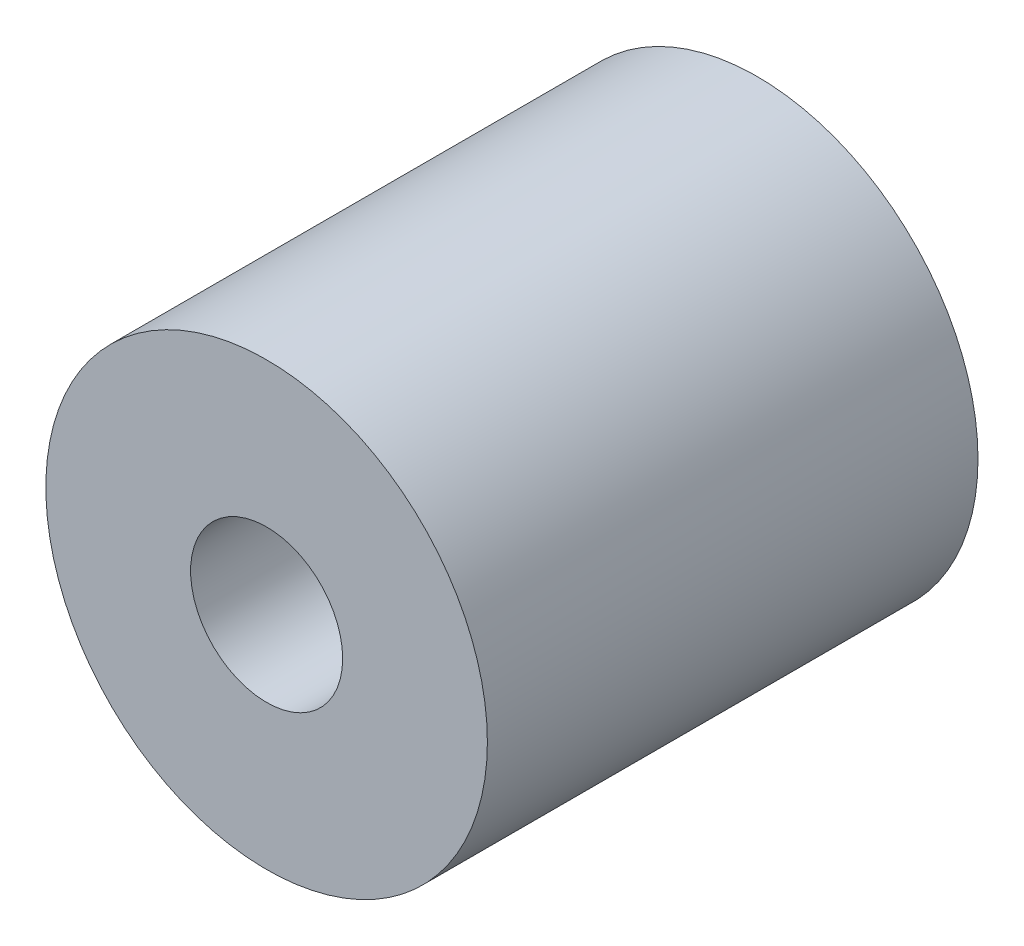
ISO-10303-21;
HEADER;
FILE_DESCRIPTION(('STEP AP214'),'2;1');
FILE_NAME('part.step','',(''),(''),'','','');
FILE_SCHEMA(('AUTOMOTIVE_DESIGN { 1 0 10303 214 1 1 1 1 }'));
ENDSEC;
DATA;
#1=APPLICATION_CONTEXT('core data for automotive mechanical design processes');
#2=APPLICATION_PROTOCOL_DEFINITION('international standard','automotive_design',2000,#1);
#3=PRODUCT_CONTEXT('',#1,'mechanical');
#4=PRODUCT('Part','Part','',(#3));
#5=PRODUCT_RELATED_PRODUCT_CATEGORY('part','',(#4));
#6=PRODUCT_DEFINITION_FORMATION('','',#4);
#7=PRODUCT_DEFINITION_CONTEXT('part definition',#1,'design');
#8=PRODUCT_DEFINITION('design','',#6,#7);
#9=PRODUCT_DEFINITION_SHAPE('','',#8);
#10=(LENGTH_UNIT() NAMED_UNIT(*) SI_UNIT(.MILLI.,.METRE.));
#11=(NAMED_UNIT(*) PLANE_ANGLE_UNIT() SI_UNIT($,.RADIAN.));
#12=(NAMED_UNIT(*) SI_UNIT($,.STERADIAN.) SOLID_ANGLE_UNIT());
#13=UNCERTAINTY_MEASURE_WITH_UNIT(LENGTH_MEASURE(1.E-05),#10,'distance_accuracy_value','');
#14=(GEOMETRIC_REPRESENTATION_CONTEXT(3) GLOBAL_UNCERTAINTY_ASSIGNED_CONTEXT((#13)) GLOBAL_UNIT_ASSIGNED_CONTEXT((#10,
#11,#12)) REPRESENTATION_CONTEXT('',''));
#15=CARTESIAN_POINT('',(0.,0.,0.));
#16=DIRECTION('',(0.,0.,1.));
#17=DIRECTION('',(1.,0.,0.));
#18=AXIS2_PLACEMENT_3D('',#15,#16,#17);
#19=CARTESIAN_POINT('',(0.,0.,10.));
#20=DIRECTION('',(0.,0.,1.));
#21=DIRECTION('',(1.,0.,0.));
#22=AXIS2_PLACEMENT_3D('',#19,#20,#21);
#23=PLANE('',#22);
#24=CARTESIAN_POINT('',(0.,0.,10.));
#25=DIRECTION('',(0.,0.,1.));
#26=DIRECTION('',(1.,0.,0.));
#27=AXIS2_PLACEMENT_3D('',#24,#25,#26);
#28=CIRCLE('',#27,4.5);
#29=CARTESIAN_POINT('',(4.5,0.,10.));
#30=VERTEX_POINT('',#29);
#31=EDGE_CURVE('E10',#30,#30,#28,.T.);
#32=ORIENTED_EDGE('',*,*,#31,.T.);
#33=EDGE_LOOP('',(#32));
#34=FACE_BOUND('',#33,.T.);
#35=CARTESIAN_POINT('',(0.,0.,10.));
#36=DIRECTION('',(0.,0.,1.));
#37=DIRECTION('',(1.,0.,0.));
#38=AXIS2_PLACEMENT_3D('',#35,#36,#37);
#39=CIRCLE('',#38,1.55);
#40=CARTESIAN_POINT('',(1.55,0.,10.));
#41=VERTEX_POINT('',#40);
#42=EDGE_CURVE('E42',#41,#41,#39,.T.);
#43=ORIENTED_EDGE('',*,*,#42,.F.);
#44=EDGE_LOOP('',(#43));
#45=FACE_BOUND('',#44,.T.);
#46=ADVANCED_FACE('F31',(#34,#45),#23,.T.);
#47=CARTESIAN_POINT('',(0.,0.,0.));
#48=DIRECTION('',(0.,0.,1.));
#49=DIRECTION('',(1.,0.,0.));
#50=AXIS2_PLACEMENT_3D('',#47,#48,#49);
#51=PLANE('',#50);
#52=CARTESIAN_POINT('',(0.,0.,0.));
#53=DIRECTION('',(0.,0.,1.));
#54=DIRECTION('',(1.,0.,0.));
#55=AXIS2_PLACEMENT_3D('',#52,#53,#54);
#56=CIRCLE('',#55,4.5);
#57=CARTESIAN_POINT('',(4.5,0.,0.));
#58=VERTEX_POINT('',#57);
#59=EDGE_CURVE('E35',#58,#58,#56,.T.);
#60=ORIENTED_EDGE('',*,*,#59,.F.);
#61=EDGE_LOOP('',(#60));
#62=FACE_BOUND('',#61,.T.);
#63=CARTESIAN_POINT('',(0.,0.,0.));
#64=DIRECTION('',(0.,0.,1.));
#65=DIRECTION('',(1.,0.,0.));
#66=AXIS2_PLACEMENT_3D('',#63,#64,#65);
#67=CIRCLE('',#66,1.55);
#68=CARTESIAN_POINT('',(1.55,0.,0.));
#69=VERTEX_POINT('',#68);
#70=EDGE_CURVE('E44',#69,#69,#67,.T.);
#71=ORIENTED_EDGE('',*,*,#70,.T.);
#72=EDGE_LOOP('',(#71));
#73=FACE_BOUND('',#72,.T.);
#74=ADVANCED_FACE('F54',(#62,#73),#51,.F.);
#75=CARTESIAN_POINT('',(0.,0.,10.));
#76=DIRECTION('',(0.,0.,-1.));
#77=DIRECTION('',(-1.,0.,0.));
#78=AXIS2_PLACEMENT_3D('',#75,#76,#77);
#79=CYLINDRICAL_SURFACE('',#78,4.5);
#80=ORIENTED_EDGE('',*,*,#31,.F.);
#81=EDGE_LOOP('',(#80));
#82=FACE_BOUND('',#81,.T.);
#83=ORIENTED_EDGE('',*,*,#59,.T.);
#84=EDGE_LOOP('',(#83));
#85=FACE_BOUND('',#84,.T.);
#86=ADVANCED_FACE('F33',(#82,#85),#79,.T.);
#87=CARTESIAN_POINT('',(0.,0.,10.));
#88=DIRECTION('',(0.,0.,-1.));
#89=DIRECTION('',(-1.,0.,0.));
#90=AXIS2_PLACEMENT_3D('',#87,#88,#89);
#91=CYLINDRICAL_SURFACE('',#90,1.55);
#92=ORIENTED_EDGE('',*,*,#42,.T.);
#93=EDGE_LOOP('',(#92));
#94=FACE_BOUND('',#93,.T.);
#95=ORIENTED_EDGE('',*,*,#70,.F.);
#96=EDGE_LOOP('',(#95));
#97=FACE_BOUND('',#96,.T.);
#98=ADVANCED_FACE('F50',(#94,#97),#91,.F.);
#99=CLOSED_SHELL('',(#46,#74,#86,#98));
#100=MANIFOLD_SOLID_BREP('B2',#99);
#101=ADVANCED_BREP_SHAPE_REPRESENTATION('',(#18,#100),#14);
#102=SHAPE_DEFINITION_REPRESENTATION(#9,#101);
ENDSEC;
END-ISO-10303-21;
